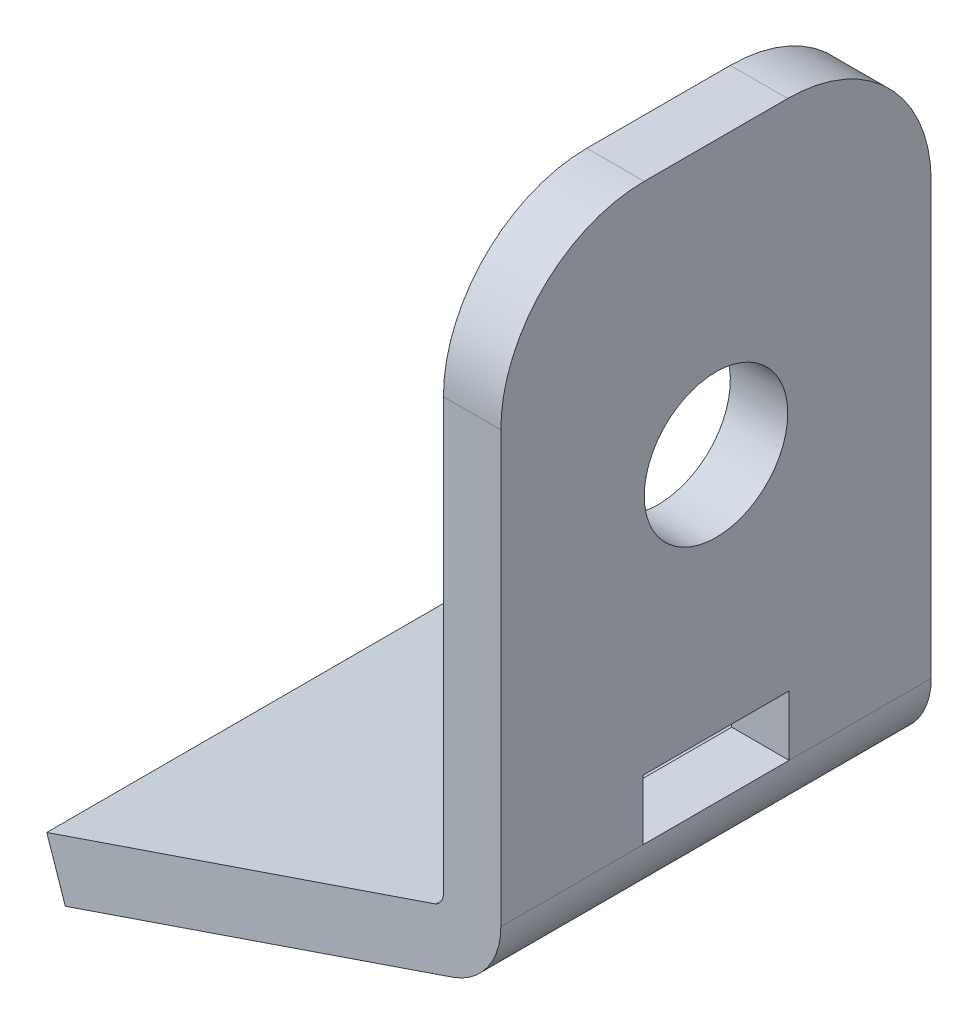
ISO-10303-21;
HEADER;
FILE_DESCRIPTION(('STEP AP214'),'2;1');
FILE_NAME('part.step','',(''),(''),'','','');
FILE_SCHEMA(('AUTOMOTIVE_DESIGN { 1 0 10303 214 1 1 1 1 }'));
ENDSEC;
DATA;
#1=APPLICATION_CONTEXT('core data for automotive mechanical design processes');
#2=APPLICATION_PROTOCOL_DEFINITION('international standard','automotive_design',2000,#1);
#3=PRODUCT_CONTEXT('',#1,'mechanical');
#4=PRODUCT('Part','Part','',(#3));
#5=PRODUCT_RELATED_PRODUCT_CATEGORY('part','',(#4));
#6=PRODUCT_DEFINITION_FORMATION('','',#4);
#7=PRODUCT_DEFINITION_CONTEXT('part definition',#1,'design');
#8=PRODUCT_DEFINITION('design','',#6,#7);
#9=PRODUCT_DEFINITION_SHAPE('','',#8);
#10=(LENGTH_UNIT() NAMED_UNIT(*) SI_UNIT(.MILLI.,.METRE.));
#11=(NAMED_UNIT(*) PLANE_ANGLE_UNIT() SI_UNIT($,.RADIAN.));
#12=(NAMED_UNIT(*) SI_UNIT($,.STERADIAN.) SOLID_ANGLE_UNIT());
#13=UNCERTAINTY_MEASURE_WITH_UNIT(LENGTH_MEASURE(1.E-05),#10,'distance_accuracy_value','');
#14=(GEOMETRIC_REPRESENTATION_CONTEXT(3) GLOBAL_UNCERTAINTY_ASSIGNED_CONTEXT((#13)) GLOBAL_UNIT_ASSIGNED_CONTEXT((#10,
#11,#12)) REPRESENTATION_CONTEXT('',''));
#15=CARTESIAN_POINT('',(0.,0.,0.));
#16=DIRECTION('',(0.,0.,1.));
#17=DIRECTION('',(1.,0.,0.));
#18=AXIS2_PLACEMENT_3D('',#15,#16,#17);
#19=CARTESIAN_POINT('',(-9.99999999999997,-375.320100819107,-15.));
#20=DIRECTION('',(1.,0.,0.));
#21=DIRECTION('',(0.,1.,0.));
#22=AXIS2_PLACEMENT_3D('',#19,#20,#21);
#23=PLANE('',#22);
#24=CARTESIAN_POINT('',(-9.99999999999997,-364.820100819107,-7.5));
#25=DIRECTION('',(-1.,0.,0.));
#26=DIRECTION('',(0.,-1.,0.));
#27=AXIS2_PLACEMENT_3D('',#24,#25,#26);
#28=CIRCLE('',#27,2.5);
#29=CARTESIAN_POINT('',(-9.99999999999997,-367.320100819107,-7.5));
#30=VERTEX_POINT('',#29);
#31=EDGE_CURVE('E177',#30,#30,#28,.T.);
#32=ORIENTED_EDGE('',*,*,#31,.F.);
#33=EDGE_LOOP('',(#32));
#34=FACE_BOUND('',#33,.T.);
#35=DIRECTION('',(0.,1.,0.));
#36=VECTOR('',#35,1.);
#37=CARTESIAN_POINT('',(-9.99999999999997,-375.320100819107,0.));
#38=LINE('',#37,#36);
#39=CARTESIAN_POINT('',(-9.99999999999997,-375.320100819107,0.));
#40=VERTEX_POINT('',#39);
#41=CARTESIAN_POINT('',(-9.99999999999997,-360.320100819107,0.));
#42=VERTEX_POINT('',#41);
#43=EDGE_CURVE('E211',#40,#42,#38,.T.);
#44=ORIENTED_EDGE('',*,*,#43,.T.);
#45=CARTESIAN_POINT('',(-9.99999999999997,-360.320100819107,-5.));
#46=DIRECTION('',(1.,0.,0.));
#47=DIRECTION('',(0.,1.,0.));
#48=AXIS2_PLACEMENT_3D('',#45,#46,#47);
#49=CIRCLE('',#48,5.);
#50=CARTESIAN_POINT('',(-9.99999999999997,-355.320100819107,-5.));
#51=VERTEX_POINT('',#50);
#52=EDGE_CURVE('E246',#42,#51,#49,.F.);
#53=ORIENTED_EDGE('',*,*,#52,.T.);
#54=DIRECTION('',(0.,0.,1.));
#55=VECTOR('',#54,1.);
#56=CARTESIAN_POINT('',(-9.99999999999997,-355.320100819107,-15.));
#57=LINE('',#56,#55);
#58=CARTESIAN_POINT('',(-9.99999999999997,-355.320100819107,-10.));
#59=VERTEX_POINT('',#58);
#60=EDGE_CURVE('E226',#59,#51,#57,.T.);
#61=ORIENTED_EDGE('',*,*,#60,.F.);
#62=CARTESIAN_POINT('',(-9.99999999999997,-360.320100819107,-10.));
#63=DIRECTION('',(1.,0.,0.));
#64=DIRECTION('',(0.,1.,0.));
#65=AXIS2_PLACEMENT_3D('',#62,#63,#64);
#66=CIRCLE('',#65,5.);
#67=CARTESIAN_POINT('',(-9.99999999999997,-360.320100819107,-15.));
#68=VERTEX_POINT('',#67);
#69=EDGE_CURVE('E244',#59,#68,#66,.F.);
#70=ORIENTED_EDGE('',*,*,#69,.T.);
#71=DIRECTION('',(0.,1.,0.));
#72=VECTOR('',#71,1.);
#73=CARTESIAN_POINT('',(-9.99999999999997,-375.320100819107,-15.));
#74=LINE('',#73,#72);
#75=CARTESIAN_POINT('',(-9.99999999999997,-375.320100819107,-15.));
#76=VERTEX_POINT('',#75);
#77=EDGE_CURVE('E192',#76,#68,#74,.T.);
#78=ORIENTED_EDGE('',*,*,#77,.F.);
#79=DIRECTION('',(0.,0.,1.));
#80=VECTOR('',#79,1.);
#81=CARTESIAN_POINT('',(-9.99999999999997,-375.320100819107,-15.));
#82=LINE('',#81,#80);
#83=CARTESIAN_POINT('',(-9.99999999999997,-375.320100819107,-10.0482237433539));
#84=VERTEX_POINT('',#83);
#85=EDGE_CURVE('E229',#76,#84,#82,.T.);
#86=ORIENTED_EDGE('',*,*,#85,.T.);
#87=DIRECTION('',(0.,1.,0.));
#88=VECTOR('',#87,1.);
#89=CARTESIAN_POINT('',(-9.99999999999997,-375.320100819107,-10.0482237433539));
#90=LINE('',#89,#88);
#91=CARTESIAN_POINT('',(-9.99999999999997,-373.22351081855,-10.0482237433539));
#92=VERTEX_POINT('',#91);
#93=EDGE_CURVE('E163',#84,#92,#90,.T.);
#94=ORIENTED_EDGE('',*,*,#93,.T.);
#95=DIRECTION('',(0.,0.,1.));
#96=VECTOR('',#95,1.);
#97=CARTESIAN_POINT('',(-9.99999999999997,-373.22351081855,-10.0482237433539));
#98=LINE('',#97,#96);
#99=CARTESIAN_POINT('',(-9.99999999999997,-373.22351081855,-4.95279767505963));
#100=VERTEX_POINT('',#99);
#101=EDGE_CURVE('E142',#92,#100,#98,.T.);
#102=ORIENTED_EDGE('',*,*,#101,.T.);
#103=DIRECTION('',(0.,1.,0.));
#104=VECTOR('',#103,1.);
#105=CARTESIAN_POINT('',(-9.99999999999997,-375.320100819107,-4.95279767505963));
#106=LINE('',#105,#104);
#107=CARTESIAN_POINT('',(-9.99999999999997,-375.320100819107,-4.95279767505963));
#108=VERTEX_POINT('',#107);
#109=EDGE_CURVE('E154',#108,#100,#106,.T.);
#110=ORIENTED_EDGE('',*,*,#109,.F.);
#111=EDGE_CURVE('E228',#108,#40,#82,.T.);
#112=ORIENTED_EDGE('',*,*,#111,.T.);
#113=EDGE_LOOP('',(#44,#53,#61,#70,#78,#86,#94,#102,#110,#112));
#114=FACE_BOUND('',#113,.T.);
#115=ADVANCED_FACE('F34',(#34,#114),#23,.F.);
#116=CARTESIAN_POINT('',(-7.99778991779578,-375.320100819107,-15.));
#117=DIRECTION('',(0.999999993894421,0.000110504109535088,0.));
#118=DIRECTION('',(-0.000110504109535088,0.999999993894421,0.));
#119=AXIS2_PLACEMENT_3D('',#116,#117,#118);
#120=PLANE('',#119);
#121=CARTESIAN_POINT('',(-7.99895021095298,-364.820100819107,-7.5));
#122=DIRECTION('',(0.999999993894421,0.000110504109535088,0.));
#123=DIRECTION('',(-0.000110504109535088,0.999999993894421,0.));
#124=AXIS2_PLACEMENT_3D('',#121,#122,#123);
#125=ELLIPSE('',#124,2.50000001526395,2.5);
#126=CARTESIAN_POINT('',(-7.9992264712285,-362.320100819107,-7.5));
#127=VERTEX_POINT('',#126);
#128=EDGE_CURVE('E180',#127,#127,#125,.T.);
#129=ORIENTED_EDGE('',*,*,#128,.F.);
#130=EDGE_LOOP('',(#129));
#131=FACE_BOUND('',#130,.T.);
#132=DIRECTION('',(0.,0.,1.));
#133=VECTOR('',#132,1.);
#134=CARTESIAN_POINT('',(-7.99999999999997,-355.320100819107,-15.));
#135=LINE('',#134,#133);
#136=CARTESIAN_POINT('',(-7.99999999999997,-355.320100819107,-10.));
#137=VERTEX_POINT('',#136);
#138=CARTESIAN_POINT('',(-7.99999999999997,-355.320100819107,-5.));
#139=VERTEX_POINT('',#138);
#140=EDGE_CURVE('E223',#137,#139,#135,.T.);
#141=ORIENTED_EDGE('',*,*,#140,.T.);
#142=CARTESIAN_POINT('',(-7.99944747944892,-360.320100819107,-5.));
#143=DIRECTION('',(0.999999993894421,0.000110504109535088,0.));
#144=DIRECTION('',(-0.000110504109535088,0.999999993894421,0.));
#145=AXIS2_PLACEMENT_3D('',#142,#143,#144);
#146=ELLIPSE('',#145,5.0000000305279,5.);
#147=CARTESIAN_POINT('',(-7.99944747944892,-360.320100819107,0.));
#148=VERTEX_POINT('',#147);
#149=EDGE_CURVE('E42',#139,#148,#146,.T.);
#150=ORIENTED_EDGE('',*,*,#149,.T.);
#151=DIRECTION('',(-0.000110504109535088,0.999999993894421,0.));
#152=VECTOR('',#151,1.);
#153=CARTESIAN_POINT('',(-7.99778991779578,-375.320100819107,0.));
#154=LINE('',#153,#152);
#155=CARTESIAN_POINT('',(-7.9977899177958,-375.320100819107,0.));
#156=VERTEX_POINT('',#155);
#157=EDGE_CURVE('E213',#156,#148,#154,.T.);
#158=ORIENTED_EDGE('',*,*,#157,.F.);
#159=DIRECTION('',(0.,0.,1.));
#160=VECTOR('',#159,1.);
#161=CARTESIAN_POINT('',(-7.9977899177958,-375.320100819107,-15.));
#162=LINE('',#161,#160);
#163=CARTESIAN_POINT('',(-7.9977899177958,-375.320100819107,-4.95279767505963));
#164=VERTEX_POINT('',#163);
#165=EDGE_CURVE('E219',#164,#156,#162,.T.);
#166=ORIENTED_EDGE('',*,*,#165,.F.);
#167=DIRECTION('',(0.000110504109535088,-0.999999993894421,0.));
#168=VECTOR('',#167,1.);
#169=CARTESIAN_POINT('',(-7.99778991779578,-375.320100819107,-4.95279767505963));
#170=LINE('',#169,#168);
#171=CARTESIAN_POINT('',(-7.99802159960826,-373.22351081855,-4.95279767505963));
#172=VERTEX_POINT('',#171);
#173=EDGE_CURVE('E170',#172,#164,#170,.T.);
#174=ORIENTED_EDGE('',*,*,#173,.F.);
#175=DIRECTION('',(0.,0.,-1.));
#176=VECTOR('',#175,1.);
#177=CARTESIAN_POINT('',(-7.99802159960826,-373.22351081855,-15.));
#178=LINE('',#177,#176);
#179=CARTESIAN_POINT('',(-7.99802159960826,-373.22351081855,-10.0482237433539));
#180=VERTEX_POINT('',#179);
#181=EDGE_CURVE('E145',#172,#180,#178,.T.);
#182=ORIENTED_EDGE('',*,*,#181,.T.);
#183=DIRECTION('',(0.000110504109535088,-0.999999993894421,0.));
#184=VECTOR('',#183,1.);
#185=CARTESIAN_POINT('',(-7.99778991779578,-375.320100819107,-10.0482237433539));
#186=LINE('',#185,#184);
#187=CARTESIAN_POINT('',(-7.9977899177958,-375.320100819107,-10.0482237433539));
#188=VERTEX_POINT('',#187);
#189=EDGE_CURVE('E174',#180,#188,#186,.T.);
#190=ORIENTED_EDGE('',*,*,#189,.T.);
#191=CARTESIAN_POINT('',(-7.9977899177958,-375.320100819107,-15.));
#192=VERTEX_POINT('',#191);
#193=EDGE_CURVE('E220',#192,#188,#162,.T.);
#194=ORIENTED_EDGE('',*,*,#193,.F.);
#195=DIRECTION('',(-0.000110504109535088,0.999999993894421,0.));
#196=VECTOR('',#195,1.);
#197=CARTESIAN_POINT('',(-7.99778991779578,-375.320100819107,-15.));
#198=LINE('',#197,#196);
#199=CARTESIAN_POINT('',(-7.99944747944892,-360.320100819107,-15.));
#200=VERTEX_POINT('',#199);
#201=EDGE_CURVE('E194',#192,#200,#198,.T.);
#202=ORIENTED_EDGE('',*,*,#201,.T.);
#203=CARTESIAN_POINT('',(-7.99944747944892,-360.320100819107,-10.));
#204=DIRECTION('',(0.999999993894421,0.000110504109535088,0.));
#205=DIRECTION('',(0.000110504109535088,-0.999999993894421,0.));
#206=AXIS2_PLACEMENT_3D('',#203,#204,#205);
#207=ELLIPSE('',#206,5.0000000305279,5.);
#208=EDGE_CURVE('E252',#200,#137,#207,.T.);
#209=ORIENTED_EDGE('',*,*,#208,.T.);
#210=EDGE_LOOP('',(#141,#150,#158,#166,#174,#182,#190,#194,#202,#209));
#211=FACE_BOUND('',#210,.T.);
#212=ADVANCED_FACE('F256',(#131,#211),#120,.T.);
#213=CARTESIAN_POINT('',(-9.64273955948167,-377.669332371071,-15.));
#214=DIRECTION('',(-0.323043540097111,0.946384103417596,0.));
#215=DIRECTION('',(-0.946384103417596,-0.323043540097111,0.));
#216=AXIS2_PLACEMENT_3D('',#213,#214,#215);
#217=PLANE('',#216);
#218=DIRECTION('',(-0.946384103417596,-0.323043540097111,0.));
#219=VECTOR('',#218,1.);
#220=CARTESIAN_POINT('',(-9.64273955948167,-377.669332371071,0.));
#221=LINE('',#220,#219);
#222=CARTESIAN_POINT('',(-9.64273955948167,-377.669332371071,0.));
#223=VERTEX_POINT('',#222);
#224=CARTESIAN_POINT('',(-23.1754299757358,-382.28864941509,0.));
#225=VERTEX_POINT('',#224);
#226=EDGE_CURVE('E200',#223,#225,#221,.T.);
#227=ORIENTED_EDGE('',*,*,#226,.T.);
#228=DIRECTION('',(0.,0.,1.));
#229=VECTOR('',#228,1.);
#230=CARTESIAN_POINT('',(-23.1754299757358,-382.28864941509,-15.));
#231=LINE('',#230,#229);
#232=CARTESIAN_POINT('',(-23.1754299757358,-382.28864941509,-15.));
#233=VERTEX_POINT('',#232);
#234=EDGE_CURVE('E236',#233,#225,#231,.T.);
#235=ORIENTED_EDGE('',*,*,#234,.F.);
#236=DIRECTION('',(-0.946384103417596,-0.323043540097111,0.));
#237=VECTOR('',#236,1.);
#238=CARTESIAN_POINT('',(-9.64273955948167,-377.669332371071,-15.));
#239=LINE('',#238,#237);
#240=CARTESIAN_POINT('',(-9.64273955948167,-377.669332371071,-15.));
#241=VERTEX_POINT('',#240);
#242=EDGE_CURVE('E181',#241,#233,#239,.T.);
#243=ORIENTED_EDGE('',*,*,#242,.F.);
#244=DIRECTION('',(0.,0.,1.));
#245=VECTOR('',#244,1.);
#246=CARTESIAN_POINT('',(-9.64273955948167,-377.669332371071,-15.));
#247=LINE('',#246,#245);
#248=EDGE_CURVE('E199',#241,#223,#247,.T.);
#249=ORIENTED_EDGE('',*,*,#248,.T.);
#250=EDGE_LOOP('',(#227,#235,#243,#249));
#251=FACE_BOUND('',#250,.T.);
#252=ADVANCED_FACE('F292',(#251),#217,.F.);
#253=CARTESIAN_POINT('',(-23.8241382022311,-380.384479307007,-15.));
#254=DIRECTION('',(-0.946577072562311,-0.322477666977677,0.));
#255=DIRECTION('',(0.322477666977677,-0.946577072562311,0.));
#256=AXIS2_PLACEMENT_3D('',#253,#254,#255);
#257=PLANE('',#256);
#258=DIRECTION('',(0.322477666977677,-0.946577072562311,0.));
#259=VECTOR('',#258,1.);
#260=CARTESIAN_POINT('',(-23.8241382022311,-380.384479307007,0.));
#261=LINE('',#260,#259);
#262=CARTESIAN_POINT('',(-23.8241382022311,-380.384479307007,0.));
#263=VERTEX_POINT('',#262);
#264=EDGE_CURVE('E203',#263,#225,#261,.T.);
#265=ORIENTED_EDGE('',*,*,#264,.F.);
#266=DIRECTION('',(0.,0.,1.));
#267=VECTOR('',#266,1.);
#268=CARTESIAN_POINT('',(-23.8241382022311,-380.384479307007,-15.));
#269=LINE('',#268,#267);
#270=CARTESIAN_POINT('',(-23.8241382022311,-380.384479307007,-15.));
#271=VERTEX_POINT('',#270);
#272=EDGE_CURVE('E233',#271,#263,#269,.T.);
#273=ORIENTED_EDGE('',*,*,#272,.F.);
#274=DIRECTION('',(0.322477666977677,-0.946577072562311,0.));
#275=VECTOR('',#274,1.);
#276=CARTESIAN_POINT('',(-23.8241382022311,-380.384479307007,-15.));
#277=LINE('',#276,#275);
#278=EDGE_CURVE('E183',#271,#233,#277,.T.);
#279=ORIENTED_EDGE('',*,*,#278,.T.);
#280=ORIENTED_EDGE('',*,*,#234,.T.);
#281=EDGE_LOOP('',(#265,#273,#279,#280));
#282=FACE_BOUND('',#281,.T.);
#283=ADVANCED_FACE('F295',(#282),#257,.T.);
#284=CARTESIAN_POINT('',(-10.2886908691296,-375.773254712625,-15.));
#285=DIRECTION('',(-0.322477666977678,0.94657707256231,0.));
#286=DIRECTION('',(-0.946577072562311,-0.322477666977678,0.));
#287=AXIS2_PLACEMENT_3D('',#284,#285,#286);
#288=PLANE('',#287);
#289=DIRECTION('',(-0.94657707256231,-0.322477666977678,0.));
#290=VECTOR('',#289,1.);
#291=CARTESIAN_POINT('',(-10.2886908691296,-375.773254712625,0.));
#292=LINE('',#291,#290);
#293=CARTESIAN_POINT('',(-10.2886908691296,-375.773254712625,0.));
#294=VERTEX_POINT('',#293);
#295=EDGE_CURVE('E206',#294,#263,#292,.T.);
#296=ORIENTED_EDGE('',*,*,#295,.F.);
#297=DIRECTION('',(0.,0.,1.));
#298=VECTOR('',#297,1.);
#299=CARTESIAN_POINT('',(-10.2886908691296,-375.773254712625,-15.));
#300=LINE('',#299,#298);
#301=CARTESIAN_POINT('',(-10.2886908691296,-375.773254712625,-15.));
#302=VERTEX_POINT('',#301);
#303=EDGE_CURVE('E231',#302,#294,#300,.T.);
#304=ORIENTED_EDGE('',*,*,#303,.F.);
#305=DIRECTION('',(-0.946577072562312,-0.322477666977673,0.));
#306=VECTOR('',#305,1.);
#307=CARTESIAN_POINT('',(-21.4549551044454,-379.577351540909,-15.));
#308=LINE('',#307,#306);
#309=EDGE_CURVE('E187',#302,#271,#308,.T.);
#310=ORIENTED_EDGE('',*,*,#309,.T.);
#311=ORIENTED_EDGE('',*,*,#272,.T.);
#312=EDGE_LOOP('',(#296,#304,#310,#311));
#313=FACE_BOUND('',#312,.T.);
#314=ADVANCED_FACE('F298',(#313),#288,.T.);
#315=CARTESIAN_POINT('',(-10.5,-375.320100819107,-15.));
#316=DIRECTION('',(0.,0.,1.));
#317=DIRECTION('',(1.,0.,0.));
#318=AXIS2_PLACEMENT_3D('',#315,#316,#317);
#319=CYLINDRICAL_SURFACE('',#318,0.500000000000024);
#320=CARTESIAN_POINT('',(-10.5,-375.320100819107,0.));
#321=DIRECTION('',(0.,0.,1.));
#322=DIRECTION('',(1.,0.,0.));
#323=AXIS2_PLACEMENT_3D('',#320,#321,#322);
#324=CIRCLE('',#323,0.500000000000024);
#325=EDGE_CURVE('E208',#294,#40,#324,.T.);
#326=ORIENTED_EDGE('',*,*,#325,.T.);
#327=ORIENTED_EDGE('',*,*,#111,.F.);
#328=DIRECTION('',(0.,0.,1.));
#329=VECTOR('',#328,1.);
#330=CARTESIAN_POINT('',(-9.99999999999997,-375.320100819107,-10.0482237433539));
#331=LINE('',#330,#329);
#332=EDGE_CURVE('E158',#84,#108,#331,.T.);
#333=ORIENTED_EDGE('',*,*,#332,.F.);
#334=ORIENTED_EDGE('',*,*,#85,.F.);
#335=CARTESIAN_POINT('',(-10.5,-375.320100819107,-15.));
#336=DIRECTION('',(0.,0.,1.));
#337=DIRECTION('',(1.,0.,0.));
#338=AXIS2_PLACEMENT_3D('',#335,#336,#337);
#339=CIRCLE('',#338,0.500000000000024);
#340=EDGE_CURVE('E190',#302,#76,#339,.T.);
#341=ORIENTED_EDGE('',*,*,#340,.F.);
#342=ORIENTED_EDGE('',*,*,#303,.T.);
#343=EDGE_LOOP('',(#326,#327,#333,#334,#341,#342));
#344=FACE_BOUND('',#343,.T.);
#345=ADVANCED_FACE('F279',(#344),#319,.F.);
#346=CARTESIAN_POINT('',(-7.99999999999997,-355.320100819107,-15.));
#347=DIRECTION('',(0.,1.,0.));
#348=DIRECTION('',(0.,0.,1.));
#349=AXIS2_PLACEMENT_3D('',#346,#347,#348);
#350=PLANE('',#349);
#351=ORIENTED_EDGE('',*,*,#60,.T.);
#352=DIRECTION('',(-1.,0.,0.));
#353=VECTOR('',#352,1.);
#354=CARTESIAN_POINT('',(-7.99999999999997,-355.320100819107,-5.));
#355=LINE('',#354,#353);
#356=EDGE_CURVE('E55',#51,#139,#355,.F.);
#357=ORIENTED_EDGE('',*,*,#356,.T.);
#358=ORIENTED_EDGE('',*,*,#140,.F.);
#359=DIRECTION('',(-1.,0.,0.));
#360=VECTOR('',#359,1.);
#361=CARTESIAN_POINT('',(-9.99999999999997,-355.320100819107,-10.));
#362=LINE('',#361,#360);
#363=EDGE_CURVE('E248',#137,#59,#362,.T.);
#364=ORIENTED_EDGE('',*,*,#363,.T.);
#365=EDGE_LOOP('',(#351,#357,#358,#364));
#366=FACE_BOUND('',#365,.T.);
#367=ADVANCED_FACE('F267',(#366),#350,.T.);
#368=CARTESIAN_POINT('',(-10.4977899177958,-375.320100819107,-15.));
#369=DIRECTION('',(0.,0.,1.));
#370=DIRECTION('',(1.,0.,0.));
#371=AXIS2_PLACEMENT_3D('',#368,#369,#370);
#372=CYLINDRICAL_SURFACE('',#371,2.50000000000001);
#373=CARTESIAN_POINT('',(-10.4977899177958,-375.320100819107,0.));
#374=DIRECTION('',(0.,0.,1.));
#375=DIRECTION('',(1.,0.,0.));
#376=AXIS2_PLACEMENT_3D('',#373,#374,#375);
#377=CIRCLE('',#376,2.50000000000001);
#378=EDGE_CURVE('E184',#223,#156,#377,.T.);
#379=ORIENTED_EDGE('',*,*,#378,.F.);
#380=ORIENTED_EDGE('',*,*,#248,.F.);
#381=CARTESIAN_POINT('',(-10.4977899177958,-375.320100819107,-15.));
#382=DIRECTION('',(0.,0.,1.));
#383=DIRECTION('',(1.,0.,0.));
#384=AXIS2_PLACEMENT_3D('',#381,#382,#383);
#385=CIRCLE('',#384,2.50000000000001);
#386=EDGE_CURVE('E196',#241,#192,#385,.T.);
#387=ORIENTED_EDGE('',*,*,#386,.T.);
#388=ORIENTED_EDGE('',*,*,#193,.T.);
#389=EDGE_CURVE('E224',#188,#164,#162,.T.);
#390=ORIENTED_EDGE('',*,*,#389,.T.);
#391=ORIENTED_EDGE('',*,*,#165,.T.);
#392=EDGE_LOOP('',(#379,#380,#387,#388,#390,#391));
#393=FACE_BOUND('',#392,.T.);
#394=ADVANCED_FACE('F287',(#393),#372,.T.);
#395=CARTESIAN_POINT('',(-10.5,-375.320100819107,-15.));
#396=DIRECTION('',(0.,0.,1.));
#397=DIRECTION('',(1.,0.,0.));
#398=AXIS2_PLACEMENT_3D('',#395,#396,#397);
#399=PLANE('',#398);
#400=ORIENTED_EDGE('',*,*,#77,.T.);
#401=DIRECTION('',(-1.,0.,0.));
#402=VECTOR('',#401,1.);
#403=CARTESIAN_POINT('',(-7.99999999999997,-360.320100819107,-15.));
#404=LINE('',#403,#402);
#405=EDGE_CURVE('E11',#68,#200,#404,.F.);
#406=ORIENTED_EDGE('',*,*,#405,.T.);
#407=ORIENTED_EDGE('',*,*,#201,.F.);
#408=ORIENTED_EDGE('',*,*,#386,.F.);
#409=ORIENTED_EDGE('',*,*,#242,.T.);
#410=ORIENTED_EDGE('',*,*,#278,.F.);
#411=ORIENTED_EDGE('',*,*,#309,.F.);
#412=ORIENTED_EDGE('',*,*,#340,.T.);
#413=EDGE_LOOP('',(#400,#406,#407,#408,#409,#410,#411,#412));
#414=FACE_BOUND('',#413,.T.);
#415=ADVANCED_FACE('F272',(#414),#399,.F.);
#416=CARTESIAN_POINT('',(-10.5,-375.320100819107,0.));
#417=DIRECTION('',(0.,0.,1.));
#418=DIRECTION('',(1.,0.,0.));
#419=AXIS2_PLACEMENT_3D('',#416,#417,#418);
#420=PLANE('',#419);
#421=ORIENTED_EDGE('',*,*,#157,.T.);
#422=DIRECTION('',(-1.,0.,0.));
#423=VECTOR('',#422,1.);
#424=CARTESIAN_POINT('',(-10.5,-360.320100819107,0.));
#425=LINE('',#424,#423);
#426=EDGE_CURVE('E241',#148,#42,#425,.T.);
#427=ORIENTED_EDGE('',*,*,#426,.T.);
#428=ORIENTED_EDGE('',*,*,#43,.F.);
#429=ORIENTED_EDGE('',*,*,#325,.F.);
#430=ORIENTED_EDGE('',*,*,#295,.T.);
#431=ORIENTED_EDGE('',*,*,#264,.T.);
#432=ORIENTED_EDGE('',*,*,#226,.F.);
#433=ORIENTED_EDGE('',*,*,#378,.T.);
#434=EDGE_LOOP('',(#421,#427,#428,#429,#430,#431,#432,#433));
#435=FACE_BOUND('',#434,.T.);
#436=ADVANCED_FACE('F261',(#435),#420,.T.);
#437=CARTESIAN_POINT('',(5.00000000000003,-364.820100819107,-7.5));
#438=DIRECTION('',(-1.,0.,0.));
#439=DIRECTION('',(0.,-1.,0.));
#440=AXIS2_PLACEMENT_3D('',#437,#438,#439);
#441=CYLINDRICAL_SURFACE('',#440,2.5);
#442=ORIENTED_EDGE('',*,*,#128,.T.);
#443=EDGE_LOOP('',(#442));
#444=FACE_BOUND('',#443,.T.);
#445=ORIENTED_EDGE('',*,*,#31,.T.);
#446=EDGE_LOOP('',(#445));
#447=FACE_BOUND('',#446,.T.);
#448=ADVANCED_FACE('F324',(#444,#447),#441,.F.);
#449=CARTESIAN_POINT('',(5.00000000000003,-375.320100819107,-10.0482237433539));
#450=DIRECTION('',(0.,-1.,0.));
#451=DIRECTION('',(1.,0.,0.));
#452=AXIS2_PLACEMENT_3D('',#449,#450,#451);
#453=PLANE('',#452);
#454=ORIENTED_EDGE('',*,*,#389,.F.);
#455=DIRECTION('',(-1.,0.,0.));
#456=VECTOR('',#455,1.);
#457=CARTESIAN_POINT('',(5.00000000000003,-375.320100819107,-10.0482237433539));
#458=LINE('',#457,#456);
#459=EDGE_CURVE('E168',#188,#84,#458,.T.);
#460=ORIENTED_EDGE('',*,*,#459,.T.);
#461=ORIENTED_EDGE('',*,*,#332,.T.);
#462=DIRECTION('',(-1.,0.,0.));
#463=VECTOR('',#462,1.);
#464=CARTESIAN_POINT('',(5.00000000000003,-375.320100819107,-4.95279767505963));
#465=LINE('',#464,#463);
#466=EDGE_CURVE('E150',#164,#108,#465,.T.);
#467=ORIENTED_EDGE('',*,*,#466,.F.);
#468=EDGE_LOOP('',(#454,#460,#461,#467));
#469=FACE_BOUND('',#468,.T.);
#470=ADVANCED_FACE('F281',(#469),#453,.F.);
#471=CARTESIAN_POINT('',(5.00000000000003,-375.320100819107,-10.0482237433539));
#472=DIRECTION('',(0.,0.,1.));
#473=DIRECTION('',(1.,0.,0.));
#474=AXIS2_PLACEMENT_3D('',#471,#472,#473);
#475=PLANE('',#474);
#476=DIRECTION('',(-1.,0.,0.));
#477=VECTOR('',#476,1.);
#478=CARTESIAN_POINT('',(5.00000000000003,-373.22351081855,-10.0482237433539));
#479=LINE('',#478,#477);
#480=EDGE_CURVE('E149',#180,#92,#479,.T.);
#481=ORIENTED_EDGE('',*,*,#480,.T.);
#482=ORIENTED_EDGE('',*,*,#93,.F.);
#483=ORIENTED_EDGE('',*,*,#459,.F.);
#484=ORIENTED_EDGE('',*,*,#189,.F.);
#485=EDGE_LOOP('',(#481,#482,#483,#484));
#486=FACE_BOUND('',#485,.T.);
#487=ADVANCED_FACE('F285',(#486),#475,.T.);
#488=CARTESIAN_POINT('',(5.00000000000003,-373.22351081855,-10.0482237433539));
#489=DIRECTION('',(0.,-1.,0.));
#490=DIRECTION('',(1.,0.,0.));
#491=AXIS2_PLACEMENT_3D('',#488,#489,#490);
#492=PLANE('',#491);
#493=DIRECTION('',(-1.,0.,0.));
#494=VECTOR('',#493,1.);
#495=CARTESIAN_POINT('',(5.00000000000003,-373.22351081855,-4.95279767505963));
#496=LINE('',#495,#494);
#497=EDGE_CURVE('E137',#172,#100,#496,.T.);
#498=ORIENTED_EDGE('',*,*,#497,.T.);
#499=ORIENTED_EDGE('',*,*,#101,.F.);
#500=ORIENTED_EDGE('',*,*,#480,.F.);
#501=ORIENTED_EDGE('',*,*,#181,.F.);
#502=EDGE_LOOP('',(#498,#499,#500,#501));
#503=FACE_BOUND('',#502,.T.);
#504=ADVANCED_FACE('F139',(#503),#492,.T.);
#505=CARTESIAN_POINT('',(5.00000000000003,-375.320100819107,-4.95279767505963));
#506=DIRECTION('',(0.,0.,1.));
#507=DIRECTION('',(1.,0.,0.));
#508=AXIS2_PLACEMENT_3D('',#505,#506,#507);
#509=PLANE('',#508);
#510=ORIENTED_EDGE('',*,*,#173,.T.);
#511=ORIENTED_EDGE('',*,*,#466,.T.);
#512=ORIENTED_EDGE('',*,*,#109,.T.);
#513=ORIENTED_EDGE('',*,*,#497,.F.);
#514=EDGE_LOOP('',(#510,#511,#512,#513));
#515=FACE_BOUND('',#514,.T.);
#516=ADVANCED_FACE('F155',(#515),#509,.F.);
#517=CARTESIAN_POINT('',(-10.5,-360.320100819107,-5.));
#518=DIRECTION('',(-1.,0.,0.));
#519=DIRECTION('',(0.,0.,1.));
#520=AXIS2_PLACEMENT_3D('',#517,#518,#519);
#521=CYLINDRICAL_SURFACE('',#520,5.);
#522=ORIENTED_EDGE('',*,*,#149,.F.);
#523=ORIENTED_EDGE('',*,*,#356,.F.);
#524=ORIENTED_EDGE('',*,*,#52,.F.);
#525=ORIENTED_EDGE('',*,*,#426,.F.);
#526=EDGE_LOOP('',(#522,#523,#524,#525));
#527=FACE_BOUND('',#526,.T.);
#528=ADVANCED_FACE('F265',(#527),#521,.T.);
#529=CARTESIAN_POINT('',(-7.99999999999997,-360.320100819107,-10.));
#530=DIRECTION('',(1.,0.,0.));
#531=DIRECTION('',(0.,0.,-1.));
#532=AXIS2_PLACEMENT_3D('',#529,#530,#531);
#533=CYLINDRICAL_SURFACE('',#532,5.);
#534=ORIENTED_EDGE('',*,*,#208,.F.);
#535=ORIENTED_EDGE('',*,*,#405,.F.);
#536=ORIENTED_EDGE('',*,*,#69,.F.);
#537=ORIENTED_EDGE('',*,*,#363,.F.);
#538=EDGE_LOOP('',(#534,#535,#536,#537));
#539=FACE_BOUND('',#538,.T.);
#540=ADVANCED_FACE('F36',(#539),#533,.T.);
#541=CLOSED_SHELL('',(#115,#212,#252,#283,#314,#345,#367,#394,#415,#436,#448,#470,#487,#504,
#516,#528,#540));
#542=MANIFOLD_SOLID_BREP('B2',#541);
#543=ADVANCED_BREP_SHAPE_REPRESENTATION('',(#18,#542),#14);
#544=SHAPE_DEFINITION_REPRESENTATION(#9,#543);
ENDSEC;
END-ISO-10303-21;
